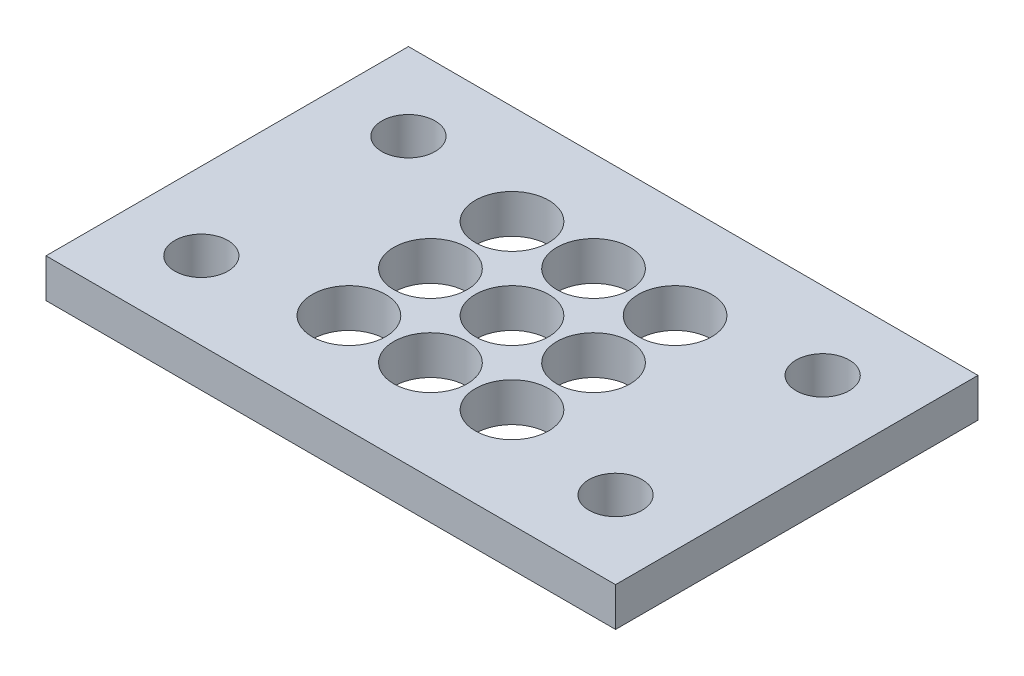
ISO-10303-21;
HEADER;
FILE_DESCRIPTION(('STEP AP214'),'2;1');
FILE_NAME('part.step','',(''),(''),'','','');
FILE_SCHEMA(('AUTOMOTIVE_DESIGN { 1 0 10303 214 1 1 1 1 }'));
ENDSEC;
DATA;
#1=APPLICATION_CONTEXT('core data for automotive mechanical design processes');
#2=APPLICATION_PROTOCOL_DEFINITION('international standard','automotive_design',2000,#1);
#3=PRODUCT_CONTEXT('',#1,'mechanical');
#4=PRODUCT('Part','Part','',(#3));
#5=PRODUCT_RELATED_PRODUCT_CATEGORY('part','',(#4));
#6=PRODUCT_DEFINITION_FORMATION('','',#4);
#7=PRODUCT_DEFINITION_CONTEXT('part definition',#1,'design');
#8=PRODUCT_DEFINITION('design','',#6,#7);
#9=PRODUCT_DEFINITION_SHAPE('','',#8);
#10=(LENGTH_UNIT() NAMED_UNIT(*) SI_UNIT(.MILLI.,.METRE.));
#11=(NAMED_UNIT(*) PLANE_ANGLE_UNIT() SI_UNIT($,.RADIAN.));
#12=(NAMED_UNIT(*) SI_UNIT($,.STERADIAN.) SOLID_ANGLE_UNIT());
#13=UNCERTAINTY_MEASURE_WITH_UNIT(LENGTH_MEASURE(1.E-05),#10,'distance_accuracy_value','');
#14=(GEOMETRIC_REPRESENTATION_CONTEXT(3) GLOBAL_UNCERTAINTY_ASSIGNED_CONTEXT((#13)) GLOBAL_UNIT_ASSIGNED_CONTEXT((#10,
#11,#12)) REPRESENTATION_CONTEXT('',''));
#15=CARTESIAN_POINT('',(0.,0.,0.));
#16=DIRECTION('',(0.,0.,1.));
#17=DIRECTION('',(1.,0.,0.));
#18=AXIS2_PLACEMENT_3D('',#15,#16,#17);
#19=CARTESIAN_POINT('',(0.,4.7625,0.));
#20=DIRECTION('',(0.,0.,-1.));
#21=DIRECTION('',(-1.,0.,0.));
#22=AXIS2_PLACEMENT_3D('',#19,#20,#21);
#23=PLANE('',#22);
#24=DIRECTION('',(1.,0.,0.));
#25=VECTOR('',#24,1.);
#26=CARTESIAN_POINT('',(0.,0.,0.));
#27=LINE('',#26,#25);
#28=CARTESIAN_POINT('',(0.,0.,0.));
#29=VERTEX_POINT('',#28);
#30=CARTESIAN_POINT('',(69.85,0.,0.));
#31=VERTEX_POINT('',#30);
#32=EDGE_CURVE('E168',#29,#31,#27,.T.);
#33=ORIENTED_EDGE('',*,*,#32,.T.);
#34=DIRECTION('',(0.,-1.,0.));
#35=VECTOR('',#34,1.);
#36=CARTESIAN_POINT('',(69.85,4.7625,0.));
#37=LINE('',#36,#35);
#38=CARTESIAN_POINT('',(69.85,4.7625,0.));
#39=VERTEX_POINT('',#38);
#40=EDGE_CURVE('E11',#39,#31,#37,.T.);
#41=ORIENTED_EDGE('',*,*,#40,.F.);
#42=DIRECTION('',(1.,0.,0.));
#43=VECTOR('',#42,1.);
#44=CARTESIAN_POINT('',(0.,4.7625,0.));
#45=LINE('',#44,#43);
#46=CARTESIAN_POINT('',(0.,4.7625,0.));
#47=VERTEX_POINT('',#46);
#48=EDGE_CURVE('E98',#47,#39,#45,.T.);
#49=ORIENTED_EDGE('',*,*,#48,.F.);
#50=DIRECTION('',(0.,-1.,0.));
#51=VECTOR('',#50,1.);
#52=CARTESIAN_POINT('',(0.,4.7625,0.));
#53=LINE('',#52,#51);
#54=EDGE_CURVE('E65',#47,#29,#53,.T.);
#55=ORIENTED_EDGE('',*,*,#54,.T.);
#56=EDGE_LOOP('',(#33,#41,#49,#55));
#57=FACE_BOUND('',#56,.T.);
#58=ADVANCED_FACE('F47',(#57),#23,.F.);
#59=CARTESIAN_POINT('',(69.85,4.7625,0.));
#60=DIRECTION('',(-1.,0.,0.));
#61=DIRECTION('',(0.,0.,1.));
#62=AXIS2_PLACEMENT_3D('',#59,#60,#61);
#63=PLANE('',#62);
#64=DIRECTION('',(0.,0.,-1.));
#65=VECTOR('',#64,1.);
#66=CARTESIAN_POINT('',(69.85,0.,0.));
#67=LINE('',#66,#65);
#68=CARTESIAN_POINT('',(69.85,0.,-44.45));
#69=VERTEX_POINT('',#68);
#70=EDGE_CURVE('E104',#31,#69,#67,.T.);
#71=ORIENTED_EDGE('',*,*,#70,.T.);
#72=DIRECTION('',(0.,-1.,0.));
#73=VECTOR('',#72,1.);
#74=CARTESIAN_POINT('',(69.85,4.7625,-44.45));
#75=LINE('',#74,#73);
#76=CARTESIAN_POINT('',(69.85,4.7625,-44.45));
#77=VERTEX_POINT('',#76);
#78=EDGE_CURVE('E57',#77,#69,#75,.T.);
#79=ORIENTED_EDGE('',*,*,#78,.F.);
#80=DIRECTION('',(0.,0.,-1.));
#81=VECTOR('',#80,1.);
#82=CARTESIAN_POINT('',(69.85,4.7625,0.));
#83=LINE('',#82,#81);
#84=EDGE_CURVE('E90',#39,#77,#83,.T.);
#85=ORIENTED_EDGE('',*,*,#84,.F.);
#86=ORIENTED_EDGE('',*,*,#40,.T.);
#87=EDGE_LOOP('',(#71,#79,#85,#86));
#88=FACE_BOUND('',#87,.T.);
#89=ADVANCED_FACE('F103',(#88),#63,.F.);
#90=CARTESIAN_POINT('',(0.,4.7625,-44.45));
#91=DIRECTION('',(0.,0.,-1.));
#92=DIRECTION('',(-1.,0.,0.));
#93=AXIS2_PLACEMENT_3D('',#90,#91,#92);
#94=PLANE('',#93);
#95=DIRECTION('',(1.,0.,0.));
#96=VECTOR('',#95,1.);
#97=CARTESIAN_POINT('',(0.,0.,-44.45));
#98=LINE('',#97,#96);
#99=CARTESIAN_POINT('',(0.,0.,-44.45));
#100=VERTEX_POINT('',#99);
#101=EDGE_CURVE('E173',#100,#69,#98,.T.);
#102=ORIENTED_EDGE('',*,*,#101,.F.);
#103=DIRECTION('',(0.,-1.,0.));
#104=VECTOR('',#103,1.);
#105=CARTESIAN_POINT('',(0.,4.7625,-44.45));
#106=LINE('',#105,#104);
#107=CARTESIAN_POINT('',(0.,4.7625,-44.45));
#108=VERTEX_POINT('',#107);
#109=EDGE_CURVE('E79',#108,#100,#106,.T.);
#110=ORIENTED_EDGE('',*,*,#109,.F.);
#111=DIRECTION('',(1.,0.,0.));
#112=VECTOR('',#111,1.);
#113=CARTESIAN_POINT('',(0.,4.7625,-44.45));
#114=LINE('',#113,#112);
#115=EDGE_CURVE('E97',#108,#77,#114,.T.);
#116=ORIENTED_EDGE('',*,*,#115,.T.);
#117=ORIENTED_EDGE('',*,*,#78,.T.);
#118=EDGE_LOOP('',(#102,#110,#116,#117));
#119=FACE_BOUND('',#118,.T.);
#120=ADVANCED_FACE('F108',(#119),#94,.T.);
#121=CARTESIAN_POINT('',(9.525,4.7625,-34.925));
#122=DIRECTION('',(0.,-1.,0.));
#123=DIRECTION('',(0.,0.,-1.));
#124=AXIS2_PLACEMENT_3D('',#121,#122,#123);
#125=CYLINDRICAL_SURFACE('',#124,3.2639);
#126=CARTESIAN_POINT('',(9.525,4.7625,-34.925));
#127=DIRECTION('',(0.,1.,0.));
#128=DIRECTION('',(0.,0.,1.));
#129=AXIS2_PLACEMENT_3D('',#126,#127,#128);
#130=CIRCLE('',#129,3.2639);
#131=CARTESIAN_POINT('',(9.525,4.7625,-31.6611));
#132=VERTEX_POINT('',#131);
#133=EDGE_CURVE('E235',#132,#132,#130,.T.);
#134=ORIENTED_EDGE('',*,*,#133,.T.);
#135=EDGE_LOOP('',(#134));
#136=FACE_BOUND('',#135,.T.);
#137=CARTESIAN_POINT('',(9.525,0.,-34.925));
#138=DIRECTION('',(0.,1.,0.));
#139=DIRECTION('',(0.,0.,1.));
#140=AXIS2_PLACEMENT_3D('',#137,#138,#139);
#141=CIRCLE('',#140,3.2639);
#142=CARTESIAN_POINT('',(9.525,0.,-31.6611));
#143=VERTEX_POINT('',#142);
#144=EDGE_CURVE('E164',#143,#143,#141,.T.);
#145=ORIENTED_EDGE('',*,*,#144,.F.);
#146=EDGE_LOOP('',(#145));
#147=FACE_BOUND('',#146,.T.);
#148=ADVANCED_FACE('F241',(#136,#147),#125,.F.);
#149=CARTESIAN_POINT('',(60.325,4.7625,-34.925));
#150=DIRECTION('',(0.,-1.,0.));
#151=DIRECTION('',(0.,0.,-1.));
#152=AXIS2_PLACEMENT_3D('',#149,#150,#151);
#153=CYLINDRICAL_SURFACE('',#152,3.2639);
#154=CARTESIAN_POINT('',(60.325,4.7625,-34.925));
#155=DIRECTION('',(0.,1.,0.));
#156=DIRECTION('',(0.,0.,1.));
#157=AXIS2_PLACEMENT_3D('',#154,#155,#156);
#158=CIRCLE('',#157,3.2639);
#159=CARTESIAN_POINT('',(60.325,4.7625,-31.6611));
#160=VERTEX_POINT('',#159);
#161=EDGE_CURVE('E231',#160,#160,#158,.T.);
#162=ORIENTED_EDGE('',*,*,#161,.T.);
#163=EDGE_LOOP('',(#162));
#164=FACE_BOUND('',#163,.T.);
#165=CARTESIAN_POINT('',(60.325,0.,-34.925));
#166=DIRECTION('',(0.,1.,0.));
#167=DIRECTION('',(0.,0.,1.));
#168=AXIS2_PLACEMENT_3D('',#165,#166,#167);
#169=CIRCLE('',#168,3.2639);
#170=CARTESIAN_POINT('',(60.325,0.,-31.6611));
#171=VERTEX_POINT('',#170);
#172=EDGE_CURVE('E160',#171,#171,#169,.T.);
#173=ORIENTED_EDGE('',*,*,#172,.F.);
#174=EDGE_LOOP('',(#173));
#175=FACE_BOUND('',#174,.T.);
#176=ADVANCED_FACE('F267',(#164,#175),#153,.F.);
#177=CARTESIAN_POINT('',(9.52499999999999,4.7625,-9.525));
#178=DIRECTION('',(0.,-1.,0.));
#179=DIRECTION('',(0.,0.,-1.));
#180=AXIS2_PLACEMENT_3D('',#177,#178,#179);
#181=CYLINDRICAL_SURFACE('',#180,3.2639);
#182=CARTESIAN_POINT('',(9.52499999999999,4.7625,-9.525));
#183=DIRECTION('',(0.,1.,0.));
#184=DIRECTION('',(0.,0.,1.));
#185=AXIS2_PLACEMENT_3D('',#182,#183,#184);
#186=CIRCLE('',#185,3.2639);
#187=CARTESIAN_POINT('',(9.52499999999999,4.7625,-6.2611));
#188=VERTEX_POINT('',#187);
#189=EDGE_CURVE('E227',#188,#188,#186,.T.);
#190=ORIENTED_EDGE('',*,*,#189,.T.);
#191=EDGE_LOOP('',(#190));
#192=FACE_BOUND('',#191,.T.);
#193=CARTESIAN_POINT('',(9.52499999999999,0.,-9.525));
#194=DIRECTION('',(0.,1.,0.));
#195=DIRECTION('',(0.,0.,1.));
#196=AXIS2_PLACEMENT_3D('',#193,#194,#195);
#197=CIRCLE('',#196,3.2639);
#198=CARTESIAN_POINT('',(9.52499999999999,0.,-6.2611));
#199=VERTEX_POINT('',#198);
#200=EDGE_CURVE('E156',#199,#199,#197,.T.);
#201=ORIENTED_EDGE('',*,*,#200,.F.);
#202=EDGE_LOOP('',(#201));
#203=FACE_BOUND('',#202,.T.);
#204=ADVANCED_FACE('F270',(#192,#203),#181,.F.);
#205=CARTESIAN_POINT('',(60.325,4.7625,-9.525));
#206=DIRECTION('',(0.,-1.,0.));
#207=DIRECTION('',(0.,0.,-1.));
#208=AXIS2_PLACEMENT_3D('',#205,#206,#207);
#209=CYLINDRICAL_SURFACE('',#208,3.26389999999999);
#210=CARTESIAN_POINT('',(60.325,4.7625,-9.525));
#211=DIRECTION('',(0.,1.,0.));
#212=DIRECTION('',(0.,0.,1.));
#213=AXIS2_PLACEMENT_3D('',#210,#211,#212);
#214=CIRCLE('',#213,3.26389999999999);
#215=CARTESIAN_POINT('',(60.325,4.7625,-6.2611));
#216=VERTEX_POINT('',#215);
#217=EDGE_CURVE('E223',#216,#216,#214,.T.);
#218=ORIENTED_EDGE('',*,*,#217,.T.);
#219=EDGE_LOOP('',(#218));
#220=FACE_BOUND('',#219,.T.);
#221=CARTESIAN_POINT('',(60.325,0.,-9.525));
#222=DIRECTION('',(0.,1.,0.));
#223=DIRECTION('',(0.,0.,1.));
#224=AXIS2_PLACEMENT_3D('',#221,#222,#223);
#225=CIRCLE('',#224,3.26389999999999);
#226=CARTESIAN_POINT('',(60.325,0.,-6.2611));
#227=VERTEX_POINT('',#226);
#228=EDGE_CURVE('E152',#227,#227,#225,.T.);
#229=ORIENTED_EDGE('',*,*,#228,.F.);
#230=EDGE_LOOP('',(#229));
#231=FACE_BOUND('',#230,.T.);
#232=ADVANCED_FACE('F274',(#220,#231),#209,.F.);
#233=CARTESIAN_POINT('',(34.925,4.7625,-22.225));
#234=DIRECTION('',(0.,-1.,0.));
#235=DIRECTION('',(0.,0.,-1.));
#236=AXIS2_PLACEMENT_3D('',#233,#234,#235);
#237=CYLINDRICAL_SURFACE('',#236,4.5);
#238=CARTESIAN_POINT('',(34.925,4.7625,-22.225));
#239=DIRECTION('',(0.,1.,0.));
#240=DIRECTION('',(0.,0.,1.));
#241=AXIS2_PLACEMENT_3D('',#238,#239,#240);
#242=CIRCLE('',#241,4.5);
#243=CARTESIAN_POINT('',(34.925,4.7625,-17.725));
#244=VERTEX_POINT('',#243);
#245=EDGE_CURVE('E219',#244,#244,#242,.T.);
#246=ORIENTED_EDGE('',*,*,#245,.T.);
#247=EDGE_LOOP('',(#246));
#248=FACE_BOUND('',#247,.T.);
#249=CARTESIAN_POINT('',(34.925,0.,-22.225));
#250=DIRECTION('',(0.,1.,0.));
#251=DIRECTION('',(0.,0.,1.));
#252=AXIS2_PLACEMENT_3D('',#249,#250,#251);
#253=CIRCLE('',#252,4.5);
#254=CARTESIAN_POINT('',(34.925,0.,-17.725));
#255=VERTEX_POINT('',#254);
#256=EDGE_CURVE('E148',#255,#255,#253,.T.);
#257=ORIENTED_EDGE('',*,*,#256,.F.);
#258=EDGE_LOOP('',(#257));
#259=FACE_BOUND('',#258,.T.);
#260=ADVANCED_FACE('F278',(#248,#259),#237,.F.);
#261=CARTESIAN_POINT('',(44.925,4.7625,-22.225));
#262=DIRECTION('',(0.,-1.,0.));
#263=DIRECTION('',(0.,0.,-1.));
#264=AXIS2_PLACEMENT_3D('',#261,#262,#263);
#265=CYLINDRICAL_SURFACE('',#264,4.5);
#266=CARTESIAN_POINT('',(44.925,4.7625,-22.225));
#267=DIRECTION('',(0.,1.,0.));
#268=DIRECTION('',(0.,0.,1.));
#269=AXIS2_PLACEMENT_3D('',#266,#267,#268);
#270=CIRCLE('',#269,4.5);
#271=CARTESIAN_POINT('',(44.925,4.7625,-17.725));
#272=VERTEX_POINT('',#271);
#273=EDGE_CURVE('E215',#272,#272,#270,.T.);
#274=ORIENTED_EDGE('',*,*,#273,.T.);
#275=EDGE_LOOP('',(#274));
#276=FACE_BOUND('',#275,.T.);
#277=CARTESIAN_POINT('',(44.925,0.,-22.225));
#278=DIRECTION('',(0.,1.,0.));
#279=DIRECTION('',(0.,0.,1.));
#280=AXIS2_PLACEMENT_3D('',#277,#278,#279);
#281=CIRCLE('',#280,4.5);
#282=CARTESIAN_POINT('',(44.925,0.,-17.725));
#283=VERTEX_POINT('',#282);
#284=EDGE_CURVE('E144',#283,#283,#281,.T.);
#285=ORIENTED_EDGE('',*,*,#284,.F.);
#286=EDGE_LOOP('',(#285));
#287=FACE_BOUND('',#286,.T.);
#288=ADVANCED_FACE('F282',(#276,#287),#265,.F.);
#289=CARTESIAN_POINT('',(44.925,4.7625,-32.2250000000001));
#290=DIRECTION('',(0.,-1.,0.));
#291=DIRECTION('',(0.,0.,-1.));
#292=AXIS2_PLACEMENT_3D('',#289,#290,#291);
#293=CYLINDRICAL_SURFACE('',#292,4.5);
#294=CARTESIAN_POINT('',(44.925,4.7625,-32.2250000000001));
#295=DIRECTION('',(0.,1.,0.));
#296=DIRECTION('',(0.,0.,1.));
#297=AXIS2_PLACEMENT_3D('',#294,#295,#296);
#298=CIRCLE('',#297,4.5);
#299=CARTESIAN_POINT('',(44.925,4.7625,-27.7250000000001));
#300=VERTEX_POINT('',#299);
#301=EDGE_CURVE('E211',#300,#300,#298,.T.);
#302=ORIENTED_EDGE('',*,*,#301,.T.);
#303=EDGE_LOOP('',(#302));
#304=FACE_BOUND('',#303,.T.);
#305=CARTESIAN_POINT('',(44.925,0.,-32.2250000000001));
#306=DIRECTION('',(0.,1.,0.));
#307=DIRECTION('',(0.,0.,1.));
#308=AXIS2_PLACEMENT_3D('',#305,#306,#307);
#309=CIRCLE('',#308,4.5);
#310=CARTESIAN_POINT('',(44.925,0.,-27.7250000000001));
#311=VERTEX_POINT('',#310);
#312=EDGE_CURVE('E140',#311,#311,#309,.T.);
#313=ORIENTED_EDGE('',*,*,#312,.F.);
#314=EDGE_LOOP('',(#313));
#315=FACE_BOUND('',#314,.T.);
#316=ADVANCED_FACE('F286',(#304,#315),#293,.F.);
#317=CARTESIAN_POINT('',(34.925,4.7625,-32.225));
#318=DIRECTION('',(0.,-1.,0.));
#319=DIRECTION('',(0.,0.,-1.));
#320=AXIS2_PLACEMENT_3D('',#317,#318,#319);
#321=CYLINDRICAL_SURFACE('',#320,4.5);
#322=CARTESIAN_POINT('',(34.925,4.7625,-32.225));
#323=DIRECTION('',(0.,1.,0.));
#324=DIRECTION('',(0.,0.,1.));
#325=AXIS2_PLACEMENT_3D('',#322,#323,#324);
#326=CIRCLE('',#325,4.5);
#327=CARTESIAN_POINT('',(34.925,4.7625,-27.725));
#328=VERTEX_POINT('',#327);
#329=EDGE_CURVE('E207',#328,#328,#326,.T.);
#330=ORIENTED_EDGE('',*,*,#329,.T.);
#331=EDGE_LOOP('',(#330));
#332=FACE_BOUND('',#331,.T.);
#333=CARTESIAN_POINT('',(34.925,0.,-32.225));
#334=DIRECTION('',(0.,1.,0.));
#335=DIRECTION('',(0.,0.,1.));
#336=AXIS2_PLACEMENT_3D('',#333,#334,#335);
#337=CIRCLE('',#336,4.5);
#338=CARTESIAN_POINT('',(34.925,0.,-27.725));
#339=VERTEX_POINT('',#338);
#340=EDGE_CURVE('E136',#339,#339,#337,.T.);
#341=ORIENTED_EDGE('',*,*,#340,.F.);
#342=EDGE_LOOP('',(#341));
#343=FACE_BOUND('',#342,.T.);
#344=ADVANCED_FACE('F290',(#332,#343),#321,.F.);
#345=CARTESIAN_POINT('',(24.925,4.7625,-22.2249999999999));
#346=DIRECTION('',(0.,-1.,0.));
#347=DIRECTION('',(0.,0.,-1.));
#348=AXIS2_PLACEMENT_3D('',#345,#346,#347);
#349=CYLINDRICAL_SURFACE('',#348,4.5);
#350=CARTESIAN_POINT('',(24.925,4.7625,-22.2249999999999));
#351=DIRECTION('',(0.,1.,0.));
#352=DIRECTION('',(0.,0.,1.));
#353=AXIS2_PLACEMENT_3D('',#350,#351,#352);
#354=CIRCLE('',#353,4.5);
#355=CARTESIAN_POINT('',(24.925,4.7625,-17.7249999999999));
#356=VERTEX_POINT('',#355);
#357=EDGE_CURVE('E203',#356,#356,#354,.T.);
#358=ORIENTED_EDGE('',*,*,#357,.T.);
#359=EDGE_LOOP('',(#358));
#360=FACE_BOUND('',#359,.T.);
#361=CARTESIAN_POINT('',(24.925,0.,-22.2249999999999));
#362=DIRECTION('',(0.,1.,0.));
#363=DIRECTION('',(0.,0.,1.));
#364=AXIS2_PLACEMENT_3D('',#361,#362,#363);
#365=CIRCLE('',#364,4.5);
#366=CARTESIAN_POINT('',(24.925,0.,-17.7249999999999));
#367=VERTEX_POINT('',#366);
#368=EDGE_CURVE('E132',#367,#367,#365,.T.);
#369=ORIENTED_EDGE('',*,*,#368,.F.);
#370=EDGE_LOOP('',(#369));
#371=FACE_BOUND('',#370,.T.);
#372=ADVANCED_FACE('F294',(#360,#371),#349,.F.);
#373=CARTESIAN_POINT('',(24.925,4.7625,-32.2249999999999));
#374=DIRECTION('',(0.,-1.,0.));
#375=DIRECTION('',(0.,0.,-1.));
#376=AXIS2_PLACEMENT_3D('',#373,#374,#375);
#377=CYLINDRICAL_SURFACE('',#376,4.5);
#378=CARTESIAN_POINT('',(24.925,4.7625,-32.2249999999999));
#379=DIRECTION('',(0.,1.,0.));
#380=DIRECTION('',(0.,0.,1.));
#381=AXIS2_PLACEMENT_3D('',#378,#379,#380);
#382=CIRCLE('',#381,4.5);
#383=CARTESIAN_POINT('',(24.925,4.7625,-27.7249999999999));
#384=VERTEX_POINT('',#383);
#385=EDGE_CURVE('E199',#384,#384,#382,.T.);
#386=ORIENTED_EDGE('',*,*,#385,.T.);
#387=EDGE_LOOP('',(#386));
#388=FACE_BOUND('',#387,.T.);
#389=CARTESIAN_POINT('',(24.925,0.,-32.2249999999999));
#390=DIRECTION('',(0.,1.,0.));
#391=DIRECTION('',(0.,0.,1.));
#392=AXIS2_PLACEMENT_3D('',#389,#390,#391);
#393=CIRCLE('',#392,4.5);
#394=CARTESIAN_POINT('',(24.925,0.,-27.7249999999999));
#395=VERTEX_POINT('',#394);
#396=EDGE_CURVE('E128',#395,#395,#393,.T.);
#397=ORIENTED_EDGE('',*,*,#396,.F.);
#398=EDGE_LOOP('',(#397));
#399=FACE_BOUND('',#398,.T.);
#400=ADVANCED_FACE('F298',(#388,#399),#377,.F.);
#401=CARTESIAN_POINT('',(24.9250000000001,4.7625,-12.2249999999999));
#402=DIRECTION('',(0.,-1.,0.));
#403=DIRECTION('',(0.,0.,-1.));
#404=AXIS2_PLACEMENT_3D('',#401,#402,#403);
#405=CYLINDRICAL_SURFACE('',#404,4.5);
#406=CARTESIAN_POINT('',(24.9250000000001,4.7625,-12.2249999999999));
#407=DIRECTION('',(0.,1.,0.));
#408=DIRECTION('',(0.,0.,1.));
#409=AXIS2_PLACEMENT_3D('',#406,#407,#408);
#410=CIRCLE('',#409,4.5);
#411=CARTESIAN_POINT('',(24.9250000000001,4.7625,-7.72499999999993));
#412=VERTEX_POINT('',#411);
#413=EDGE_CURVE('E193',#412,#412,#410,.T.);
#414=ORIENTED_EDGE('',*,*,#413,.T.);
#415=EDGE_LOOP('',(#414));
#416=FACE_BOUND('',#415,.T.);
#417=CARTESIAN_POINT('',(24.9250000000001,0.,-12.2249999999999));
#418=DIRECTION('',(0.,1.,0.));
#419=DIRECTION('',(0.,0.,1.));
#420=AXIS2_PLACEMENT_3D('',#417,#418,#419);
#421=CIRCLE('',#420,4.5);
#422=CARTESIAN_POINT('',(24.9250000000001,0.,-7.72499999999993));
#423=VERTEX_POINT('',#422);
#424=EDGE_CURVE('E124',#423,#423,#421,.T.);
#425=ORIENTED_EDGE('',*,*,#424,.F.);
#426=EDGE_LOOP('',(#425));
#427=FACE_BOUND('',#426,.T.);
#428=ADVANCED_FACE('F302',(#416,#427),#405,.F.);
#429=CARTESIAN_POINT('',(34.9250000000001,4.7625,-12.225));
#430=DIRECTION('',(0.,-1.,0.));
#431=DIRECTION('',(0.,0.,-1.));
#432=AXIS2_PLACEMENT_3D('',#429,#430,#431);
#433=CYLINDRICAL_SURFACE('',#432,4.5);
#434=CARTESIAN_POINT('',(34.9250000000001,4.7625,-12.225));
#435=DIRECTION('',(0.,1.,0.));
#436=DIRECTION('',(0.,0.,1.));
#437=AXIS2_PLACEMENT_3D('',#434,#435,#436);
#438=CIRCLE('',#437,4.5);
#439=CARTESIAN_POINT('',(34.9250000000001,4.7625,-7.725));
#440=VERTEX_POINT('',#439);
#441=EDGE_CURVE('E187',#440,#440,#438,.T.);
#442=ORIENTED_EDGE('',*,*,#441,.T.);
#443=EDGE_LOOP('',(#442));
#444=FACE_BOUND('',#443,.T.);
#445=CARTESIAN_POINT('',(34.9250000000001,0.,-12.225));
#446=DIRECTION('',(0.,1.,0.));
#447=DIRECTION('',(0.,0.,1.));
#448=AXIS2_PLACEMENT_3D('',#445,#446,#447);
#449=CIRCLE('',#448,4.5);
#450=CARTESIAN_POINT('',(34.9250000000001,0.,-7.725));
#451=VERTEX_POINT('',#450);
#452=EDGE_CURVE('E120',#451,#451,#449,.T.);
#453=ORIENTED_EDGE('',*,*,#452,.F.);
#454=EDGE_LOOP('',(#453));
#455=FACE_BOUND('',#454,.T.);
#456=ADVANCED_FACE('F305',(#444,#455),#433,.F.);
#457=CARTESIAN_POINT('',(44.9250000000001,4.7625,-12.2250000000001));
#458=DIRECTION('',(0.,-1.,0.));
#459=DIRECTION('',(0.,0.,-1.));
#460=AXIS2_PLACEMENT_3D('',#457,#458,#459);
#461=CYLINDRICAL_SURFACE('',#460,4.5);
#462=CARTESIAN_POINT('',(44.9250000000001,4.7625,-12.2250000000001));
#463=DIRECTION('',(0.,1.,0.));
#464=DIRECTION('',(0.,0.,1.));
#465=AXIS2_PLACEMENT_3D('',#462,#463,#464);
#466=CIRCLE('',#465,4.5);
#467=CARTESIAN_POINT('',(44.9250000000001,4.7625,-7.72500000000014));
#468=VERTEX_POINT('',#467);
#469=EDGE_CURVE('E180',#468,#468,#466,.T.);
#470=ORIENTED_EDGE('',*,*,#469,.T.);
#471=EDGE_LOOP('',(#470));
#472=FACE_BOUND('',#471,.T.);
#473=CARTESIAN_POINT('',(44.9250000000001,0.,-12.2250000000001));
#474=DIRECTION('',(0.,1.,0.));
#475=DIRECTION('',(0.,0.,1.));
#476=AXIS2_PLACEMENT_3D('',#473,#474,#475);
#477=CIRCLE('',#476,4.5);
#478=CARTESIAN_POINT('',(44.9250000000001,0.,-7.72500000000014));
#479=VERTEX_POINT('',#478);
#480=EDGE_CURVE('E116',#479,#479,#477,.T.);
#481=ORIENTED_EDGE('',*,*,#480,.F.);
#482=EDGE_LOOP('',(#481));
#483=FACE_BOUND('',#482,.T.);
#484=ADVANCED_FACE('F49',(#472,#483),#461,.F.);
#485=CARTESIAN_POINT('',(0.,4.7625,0.));
#486=DIRECTION('',(-1.,0.,0.));
#487=DIRECTION('',(0.,0.,1.));
#488=AXIS2_PLACEMENT_3D('',#485,#486,#487);
#489=PLANE('',#488);
#490=DIRECTION('',(0.,0.,-1.));
#491=VECTOR('',#490,1.);
#492=CARTESIAN_POINT('',(0.,0.,0.));
#493=LINE('',#492,#491);
#494=EDGE_CURVE('E176',#29,#100,#493,.T.);
#495=ORIENTED_EDGE('',*,*,#494,.F.);
#496=ORIENTED_EDGE('',*,*,#54,.F.);
#497=DIRECTION('',(0.,0.,-1.));
#498=VECTOR('',#497,1.);
#499=CARTESIAN_POINT('',(0.,4.7625,0.));
#500=LINE('',#499,#498);
#501=EDGE_CURVE('E110',#47,#108,#500,.T.);
#502=ORIENTED_EDGE('',*,*,#501,.T.);
#503=ORIENTED_EDGE('',*,*,#109,.T.);
#504=EDGE_LOOP('',(#495,#496,#502,#503));
#505=FACE_BOUND('',#504,.T.);
#506=ADVANCED_FACE('F246',(#505),#489,.T.);
#507=CARTESIAN_POINT('',(0.,4.7625,0.));
#508=DIRECTION('',(0.,1.,0.));
#509=DIRECTION('',(0.,0.,1.));
#510=AXIS2_PLACEMENT_3D('',#507,#508,#509);
#511=PLANE('',#510);
#512=ORIENTED_EDGE('',*,*,#469,.F.);
#513=EDGE_LOOP('',(#512));
#514=FACE_BOUND('',#513,.T.);
#515=ORIENTED_EDGE('',*,*,#441,.F.);
#516=EDGE_LOOP('',(#515));
#517=FACE_BOUND('',#516,.T.);
#518=ORIENTED_EDGE('',*,*,#413,.F.);
#519=EDGE_LOOP('',(#518));
#520=FACE_BOUND('',#519,.T.);
#521=ORIENTED_EDGE('',*,*,#385,.F.);
#522=EDGE_LOOP('',(#521));
#523=FACE_BOUND('',#522,.T.);
#524=ORIENTED_EDGE('',*,*,#357,.F.);
#525=EDGE_LOOP('',(#524));
#526=FACE_BOUND('',#525,.T.);
#527=ORIENTED_EDGE('',*,*,#329,.F.);
#528=EDGE_LOOP('',(#527));
#529=FACE_BOUND('',#528,.T.);
#530=ORIENTED_EDGE('',*,*,#301,.F.);
#531=EDGE_LOOP('',(#530));
#532=FACE_BOUND('',#531,.T.);
#533=ORIENTED_EDGE('',*,*,#273,.F.);
#534=EDGE_LOOP('',(#533));
#535=FACE_BOUND('',#534,.T.);
#536=ORIENTED_EDGE('',*,*,#245,.F.);
#537=EDGE_LOOP('',(#536));
#538=FACE_BOUND('',#537,.T.);
#539=ORIENTED_EDGE('',*,*,#217,.F.);
#540=EDGE_LOOP('',(#539));
#541=FACE_BOUND('',#540,.T.);
#542=ORIENTED_EDGE('',*,*,#189,.F.);
#543=EDGE_LOOP('',(#542));
#544=FACE_BOUND('',#543,.T.);
#545=ORIENTED_EDGE('',*,*,#161,.F.);
#546=EDGE_LOOP('',(#545));
#547=FACE_BOUND('',#546,.T.);
#548=ORIENTED_EDGE('',*,*,#133,.F.);
#549=EDGE_LOOP('',(#548));
#550=FACE_BOUND('',#549,.T.);
#551=ORIENTED_EDGE('',*,*,#48,.T.);
#552=ORIENTED_EDGE('',*,*,#84,.T.);
#553=ORIENTED_EDGE('',*,*,#115,.F.);
#554=ORIENTED_EDGE('',*,*,#501,.F.);
#555=EDGE_LOOP('',(#551,#552,#553,#554));
#556=FACE_BOUND('',#555,.T.);
#557=ADVANCED_FACE('F94',(#514,#517,#520,#523,#526,#529,#532,#535,#538,#541,#544,#547,#550,
#556),#511,.T.);
#558=CARTESIAN_POINT('',(0.,0.,0.));
#559=DIRECTION('',(0.,1.,0.));
#560=DIRECTION('',(0.,0.,1.));
#561=AXIS2_PLACEMENT_3D('',#558,#559,#560);
#562=PLANE('',#561);
#563=ORIENTED_EDGE('',*,*,#480,.T.);
#564=EDGE_LOOP('',(#563));
#565=FACE_BOUND('',#564,.T.);
#566=ORIENTED_EDGE('',*,*,#452,.T.);
#567=EDGE_LOOP('',(#566));
#568=FACE_BOUND('',#567,.T.);
#569=ORIENTED_EDGE('',*,*,#424,.T.);
#570=EDGE_LOOP('',(#569));
#571=FACE_BOUND('',#570,.T.);
#572=ORIENTED_EDGE('',*,*,#396,.T.);
#573=EDGE_LOOP('',(#572));
#574=FACE_BOUND('',#573,.T.);
#575=ORIENTED_EDGE('',*,*,#368,.T.);
#576=EDGE_LOOP('',(#575));
#577=FACE_BOUND('',#576,.T.);
#578=ORIENTED_EDGE('',*,*,#340,.T.);
#579=EDGE_LOOP('',(#578));
#580=FACE_BOUND('',#579,.T.);
#581=ORIENTED_EDGE('',*,*,#312,.T.);
#582=EDGE_LOOP('',(#581));
#583=FACE_BOUND('',#582,.T.);
#584=ORIENTED_EDGE('',*,*,#284,.T.);
#585=EDGE_LOOP('',(#584));
#586=FACE_BOUND('',#585,.T.);
#587=ORIENTED_EDGE('',*,*,#256,.T.);
#588=EDGE_LOOP('',(#587));
#589=FACE_BOUND('',#588,.T.);
#590=ORIENTED_EDGE('',*,*,#228,.T.);
#591=EDGE_LOOP('',(#590));
#592=FACE_BOUND('',#591,.T.);
#593=ORIENTED_EDGE('',*,*,#200,.T.);
#594=EDGE_LOOP('',(#593));
#595=FACE_BOUND('',#594,.T.);
#596=ORIENTED_EDGE('',*,*,#172,.T.);
#597=EDGE_LOOP('',(#596));
#598=FACE_BOUND('',#597,.T.);
#599=ORIENTED_EDGE('',*,*,#144,.T.);
#600=EDGE_LOOP('',(#599));
#601=FACE_BOUND('',#600,.T.);
#602=ORIENTED_EDGE('',*,*,#32,.F.);
#603=ORIENTED_EDGE('',*,*,#494,.T.);
#604=ORIENTED_EDGE('',*,*,#101,.T.);
#605=ORIENTED_EDGE('',*,*,#70,.F.);
#606=EDGE_LOOP('',(#602,#603,#604,#605));
#607=FACE_BOUND('',#606,.T.);
#608=ADVANCED_FACE('F245',(#565,#568,#571,#574,#577,#580,#583,#586,#589,#592,#595,#598,#601,
#607),#562,.F.);
#609=CLOSED_SHELL('',(#58,#89,#120,#148,#176,#204,#232,#260,#288,#316,#344,#372,#400,#428,#456,
#484,#506,#557,#608));
#610=MANIFOLD_SOLID_BREP('B2',#609);
#611=ADVANCED_BREP_SHAPE_REPRESENTATION('',(#18,#610),#14);
#612=SHAPE_DEFINITION_REPRESENTATION(#9,#611);
ENDSEC;
END-ISO-10303-21;
